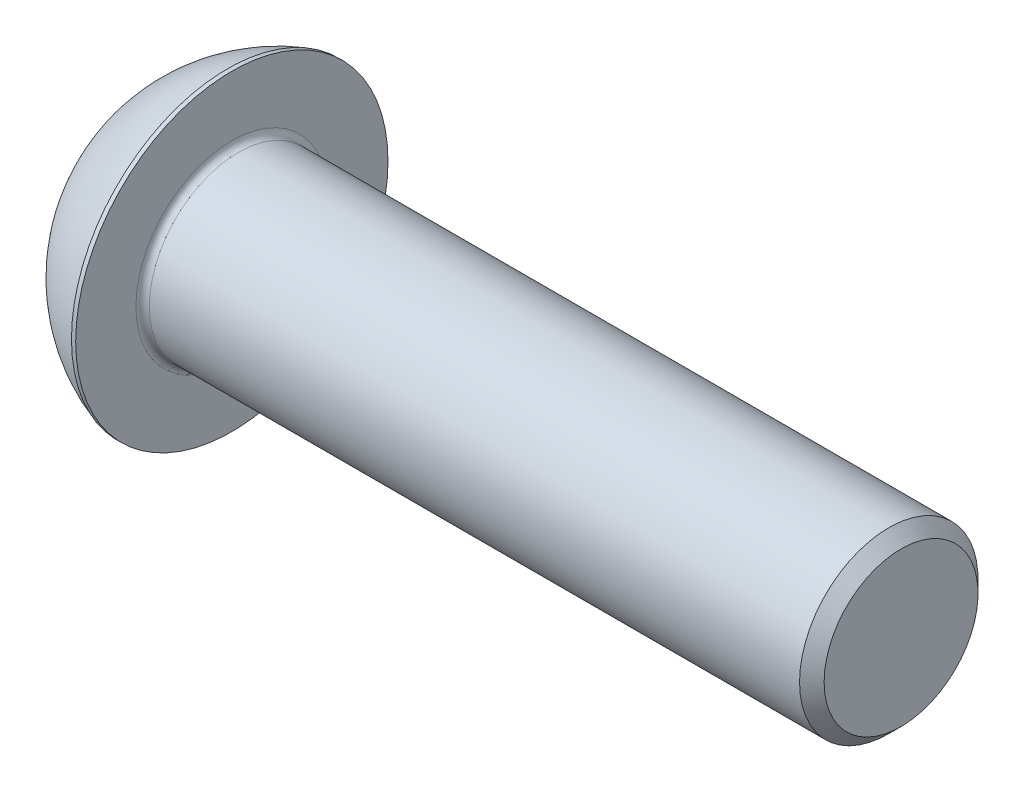
ISO-10303-21;
HEADER;
FILE_DESCRIPTION(('STEP AP214'),'2;1');
FILE_NAME('part.step','',(''),(''),'','','');
FILE_SCHEMA(('AUTOMOTIVE_DESIGN { 1 0 10303 214 1 1 1 1 }'));
ENDSEC;
DATA;
#1=APPLICATION_CONTEXT('core data for automotive mechanical design processes');
#2=APPLICATION_PROTOCOL_DEFINITION('international standard','automotive_design',2000,#1);
#3=PRODUCT_CONTEXT('',#1,'mechanical');
#4=PRODUCT('Part','Part','',(#3));
#5=PRODUCT_RELATED_PRODUCT_CATEGORY('part','',(#4));
#6=PRODUCT_DEFINITION_FORMATION('','',#4);
#7=PRODUCT_DEFINITION_CONTEXT('part definition',#1,'design');
#8=PRODUCT_DEFINITION('design','',#6,#7);
#9=PRODUCT_DEFINITION_SHAPE('','',#8);
#10=(LENGTH_UNIT() NAMED_UNIT(*) SI_UNIT(.MILLI.,.METRE.));
#11=(NAMED_UNIT(*) PLANE_ANGLE_UNIT() SI_UNIT($,.RADIAN.));
#12=(NAMED_UNIT(*) SI_UNIT($,.STERADIAN.) SOLID_ANGLE_UNIT());
#13=UNCERTAINTY_MEASURE_WITH_UNIT(LENGTH_MEASURE(1.E-05),#10,'distance_accuracy_value','');
#14=(GEOMETRIC_REPRESENTATION_CONTEXT(3) GLOBAL_UNCERTAINTY_ASSIGNED_CONTEXT((#13)) GLOBAL_UNIT_ASSIGNED_CONTEXT((#10,
#11,#12)) REPRESENTATION_CONTEXT('',''));
#15=CARTESIAN_POINT('',(0.,0.,0.));
#16=DIRECTION('',(0.,0.,1.));
#17=DIRECTION('',(1.,0.,0.));
#18=AXIS2_PLACEMENT_3D('',#15,#16,#17);
#19=CARTESIAN_POINT('',(0.,0.,0.));
#20=DIRECTION('',(-1.,0.,0.));
#21=DIRECTION('',(0.,0.,1.));
#22=AXIS2_PLACEMENT_3D('',#19,#20,#21);
#23=PLANE('',#22);
#24=CARTESIAN_POINT('',(0.,0.,0.));
#25=DIRECTION('',(-1.,0.,0.));
#26=DIRECTION('',(0.,0.,1.));
#27=AXIS2_PLACEMENT_3D('',#24,#25,#26);
#28=CIRCLE('',#27,7.);
#29=CARTESIAN_POINT('',(0.,0.,7.));
#30=VERTEX_POINT('',#29);
#31=EDGE_CURVE('E157',#30,#30,#28,.T.);
#32=ORIENTED_EDGE('',*,*,#31,.T.);
#33=EDGE_LOOP('',(#32));
#34=FACE_BOUND('',#33,.T.);
#35=DIRECTION('',(0.,-1.,0.));
#36=VECTOR('',#35,1.);
#37=CARTESIAN_POINT('',(0.,-2.88675134594813,5.));
#38=LINE('',#37,#36);
#39=CARTESIAN_POINT('',(0.,2.88675134594813,5.));
#40=VERTEX_POINT('',#39);
#41=CARTESIAN_POINT('',(0.,-2.88675134594813,5.));
#42=VERTEX_POINT('',#41);
#43=EDGE_CURVE('E47',#40,#42,#38,.T.);
#44=ORIENTED_EDGE('',*,*,#43,.T.);
#45=DIRECTION('',(0.,-0.5,-0.866025403784439));
#46=VECTOR('',#45,1.);
#47=CARTESIAN_POINT('',(0.,-5.77350269189626,0.));
#48=LINE('',#47,#46);
#49=CARTESIAN_POINT('',(0.,-5.77350269189626,0.));
#50=VERTEX_POINT('',#49);
#51=EDGE_CURVE('E250',#42,#50,#48,.T.);
#52=ORIENTED_EDGE('',*,*,#51,.T.);
#53=DIRECTION('',(0.,0.5,-0.866025403784439));
#54=VECTOR('',#53,1.);
#55=CARTESIAN_POINT('',(0.,-2.88675134594813,-5.));
#56=LINE('',#55,#54);
#57=CARTESIAN_POINT('',(0.,-2.88675134594813,-5.));
#58=VERTEX_POINT('',#57);
#59=EDGE_CURVE('E132',#50,#58,#56,.T.);
#60=ORIENTED_EDGE('',*,*,#59,.T.);
#61=DIRECTION('',(0.,1.,0.));
#62=VECTOR('',#61,1.);
#63=CARTESIAN_POINT('',(0.,2.88675134594813,-5.));
#64=LINE('',#63,#62);
#65=CARTESIAN_POINT('',(0.,2.88675134594813,-5.));
#66=VERTEX_POINT('',#65);
#67=EDGE_CURVE('E253',#58,#66,#64,.T.);
#68=ORIENTED_EDGE('',*,*,#67,.T.);
#69=DIRECTION('',(0.,0.5,0.866025403784439));
#70=VECTOR('',#69,1.);
#71=CARTESIAN_POINT('',(0.,5.77350269189626,0.));
#72=LINE('',#71,#70);
#73=CARTESIAN_POINT('',(0.,5.77350269189626,0.));
#74=VERTEX_POINT('',#73);
#75=EDGE_CURVE('E255',#66,#74,#72,.T.);
#76=ORIENTED_EDGE('',*,*,#75,.T.);
#77=DIRECTION('',(0.,-0.5,0.866025403784439));
#78=VECTOR('',#77,1.);
#79=CARTESIAN_POINT('',(0.,2.88675134594813,5.));
#80=LINE('',#79,#78);
#81=EDGE_CURVE('E257',#74,#40,#80,.T.);
#82=ORIENTED_EDGE('',*,*,#81,.T.);
#83=EDGE_LOOP('',(#44,#52,#60,#68,#76,#82));
#84=FACE_BOUND('',#83,.T.);
#85=ADVANCED_FACE('F32',(#34,#84),#23,.T.);
#86=CARTESIAN_POINT('',(12.939216152019,0.,0.));
#87=DIRECTION('',(-1.,0.,0.));
#88=DIRECTION('',(0.,1.,0.));
#89=AXIS2_PLACEMENT_3D('',#86,#87,#88);
#90=SPHERICAL_SURFACE('',#89,14.711332863771);
#91=CARTESIAN_POINT('',(8.42,0.,0.));
#92=DIRECTION('',(-1.,0.,0.));
#93=DIRECTION('',(0.,0.,1.));
#94=AXIS2_PLACEMENT_3D('',#91,#92,#93);
#95=CIRCLE('',#94,14.);
#96=CARTESIAN_POINT('',(8.42,0.,14.));
#97=VERTEX_POINT('',#96);
#98=EDGE_CURVE('E154',#97,#97,#95,.T.);
#99=ORIENTED_EDGE('',*,*,#98,.T.);
#100=EDGE_LOOP('',(#99));
#101=FACE_BOUND('',#100,.T.);
#102=ORIENTED_EDGE('',*,*,#31,.F.);
#103=EDGE_LOOP('',(#102));
#104=FACE_BOUND('',#103,.T.);
#105=ADVANCED_FACE('F178',(#101,#104),#90,.T.);
#106=CARTESIAN_POINT('',(0.,0.,0.));
#107=DIRECTION('',(-1.,0.,0.));
#108=DIRECTION('',(0.,0.,1.));
#109=AXIS2_PLACEMENT_3D('',#106,#107,#108);
#110=CYLINDRICAL_SURFACE('',#109,14.);
#111=ORIENTED_EDGE('',*,*,#98,.F.);
#112=EDGE_LOOP('',(#111));
#113=FACE_BOUND('',#112,.T.);
#114=CARTESIAN_POINT('',(8.8,0.,0.));
#115=DIRECTION('',(-1.,0.,0.));
#116=DIRECTION('',(0.,0.,1.));
#117=AXIS2_PLACEMENT_3D('',#114,#115,#116);
#118=CIRCLE('',#117,14.);
#119=CARTESIAN_POINT('',(8.8,0.,14.));
#120=VERTEX_POINT('',#119);
#121=EDGE_CURVE('E151',#120,#120,#118,.T.);
#122=ORIENTED_EDGE('',*,*,#121,.T.);
#123=EDGE_LOOP('',(#122));
#124=FACE_BOUND('',#123,.T.);
#125=ADVANCED_FACE('F183',(#113,#124),#110,.T.);
#126=CARTESIAN_POINT('',(8.8,8.,0.));
#127=DIRECTION('',(-1.,0.,0.));
#128=DIRECTION('',(0.,0.,1.));
#129=AXIS2_PLACEMENT_3D('',#126,#127,#128);
#130=PLANE('',#129);
#131=CARTESIAN_POINT('',(8.8,0.,0.));
#132=DIRECTION('',(-1.,0.,0.));
#133=DIRECTION('',(0.,0.,1.));
#134=AXIS2_PLACEMENT_3D('',#131,#132,#133);
#135=CIRCLE('',#134,8.6);
#136=CARTESIAN_POINT('',(8.8,0.,8.6));
#137=VERTEX_POINT('',#136);
#138=EDGE_CURVE('E40',#137,#137,#135,.T.);
#139=ORIENTED_EDGE('',*,*,#138,.T.);
#140=EDGE_LOOP('',(#139));
#141=FACE_BOUND('',#140,.T.);
#142=ORIENTED_EDGE('',*,*,#121,.F.);
#143=EDGE_LOOP('',(#142));
#144=FACE_BOUND('',#143,.T.);
#145=ADVANCED_FACE('F162',(#141,#144),#130,.F.);
#146=CARTESIAN_POINT('',(0.,0.,0.));
#147=DIRECTION('',(-1.,0.,0.));
#148=DIRECTION('',(0.,0.,1.));
#149=AXIS2_PLACEMENT_3D('',#146,#147,#148);
#150=CYLINDRICAL_SURFACE('',#149,8.);
#151=CARTESIAN_POINT('',(9.4,0.,0.));
#152=DIRECTION('',(-1.,0.,0.));
#153=DIRECTION('',(0.,0.,1.));
#154=AXIS2_PLACEMENT_3D('',#151,#152,#153);
#155=CIRCLE('',#154,8.);
#156=CARTESIAN_POINT('',(9.4,0.,8.));
#157=VERTEX_POINT('',#156);
#158=EDGE_CURVE('E11',#157,#157,#155,.F.);
#159=ORIENTED_EDGE('',*,*,#158,.T.);
#160=EDGE_LOOP('',(#159));
#161=FACE_BOUND('',#160,.T.);
#162=CARTESIAN_POINT('',(67.6985,0.,0.));
#163=DIRECTION('',(-1.,0.,0.));
#164=DIRECTION('',(0.,0.,1.));
#165=AXIS2_PLACEMENT_3D('',#162,#163,#164);
#166=CIRCLE('',#165,8.);
#167=CARTESIAN_POINT('',(67.6985,0.,8.));
#168=VERTEX_POINT('',#167);
#169=EDGE_CURVE('E148',#168,#168,#166,.T.);
#170=ORIENTED_EDGE('',*,*,#169,.T.);
#171=EDGE_LOOP('',(#170));
#172=FACE_BOUND('',#171,.T.);
#173=ADVANCED_FACE('F192',(#161,#172),#150,.T.);
#174=CARTESIAN_POINT('',(68.8,0.,0.));
#175=DIRECTION('',(-1.,0.,0.));
#176=DIRECTION('',(0.,0.,1.));
#177=AXIS2_PLACEMENT_3D('',#174,#175,#176);
#178=CONICAL_SURFACE('',#177,6.8985,0.78539816339744);
#179=ORIENTED_EDGE('',*,*,#169,.F.);
#180=EDGE_LOOP('',(#179));
#181=FACE_BOUND('',#180,.T.);
#182=CARTESIAN_POINT('',(68.8,0.,0.));
#183=DIRECTION('',(-1.,0.,0.));
#184=DIRECTION('',(0.,0.,1.));
#185=AXIS2_PLACEMENT_3D('',#182,#183,#184);
#186=CIRCLE('',#185,6.8985);
#187=CARTESIAN_POINT('',(68.8,0.,6.8985));
#188=VERTEX_POINT('',#187);
#189=EDGE_CURVE('E144',#188,#188,#186,.T.);
#190=ORIENTED_EDGE('',*,*,#189,.T.);
#191=EDGE_LOOP('',(#190));
#192=FACE_BOUND('',#191,.T.);
#193=ADVANCED_FACE('F173',(#181,#192),#178,.T.);
#194=CARTESIAN_POINT('',(68.8,0.,0.));
#195=DIRECTION('',(-1.,0.,0.));
#196=DIRECTION('',(0.,0.,1.));
#197=AXIS2_PLACEMENT_3D('',#194,#195,#196);
#198=PLANE('',#197);
#199=ORIENTED_EDGE('',*,*,#189,.F.);
#200=EDGE_LOOP('',(#199));
#201=FACE_BOUND('',#200,.T.);
#202=ADVANCED_FACE('F166',(#201),#198,.F.);
#203=CARTESIAN_POINT('',(9.4,0.,0.));
#204=DIRECTION('',(-1.,0.,0.));
#205=DIRECTION('',(0.,0.,1.));
#206=AXIS2_PLACEMENT_3D('',#203,#204,#205);
#207=TOROIDAL_SURFACE('',#206,8.6,0.6);
#208=ORIENTED_EDGE('',*,*,#158,.F.);
#209=EDGE_LOOP('',(#208));
#210=FACE_BOUND('',#209,.T.);
#211=ORIENTED_EDGE('',*,*,#138,.F.);
#212=EDGE_LOOP('',(#211));
#213=FACE_BOUND('',#212,.T.);
#214=ADVANCED_FACE('F34',(#210,#213),#207,.F.);
#215=CARTESIAN_POINT('',(3.0988,-5.77350269189626,0.));
#216=DIRECTION('',(0.,0.866025403784439,-0.5));
#217=DIRECTION('',(0.,0.5,0.866025403784439));
#218=AXIS2_PLACEMENT_3D('',#215,#216,#217);
#219=PLANE('',#218);
#220=DIRECTION('',(0.,-0.5,-0.866025403784439));
#221=VECTOR('',#220,1.);
#222=CARTESIAN_POINT('',(3.0988,-5.77350269189626,0.));
#223=LINE('',#222,#221);
#224=CARTESIAN_POINT('',(3.0988,-2.88675134594813,5.));
#225=VERTEX_POINT('',#224);
#226=CARTESIAN_POINT('',(3.0988,-4.33012701892219,2.5));
#227=VERTEX_POINT('',#226);
#228=EDGE_CURVE('E115',#225,#227,#223,.T.);
#229=ORIENTED_EDGE('',*,*,#228,.T.);
#230=CARTESIAN_POINT('',(3.0988,-5.77350269189626,0.));
#231=VERTEX_POINT('',#230);
#232=EDGE_CURVE('E108',#227,#231,#223,.T.);
#233=ORIENTED_EDGE('',*,*,#232,.T.);
#234=DIRECTION('',(-1.,0.,0.));
#235=VECTOR('',#234,1.);
#236=CARTESIAN_POINT('',(3.0988,-5.77350269189626,0.));
#237=LINE('',#236,#235);
#238=EDGE_CURVE('E112',#231,#50,#237,.T.);
#239=ORIENTED_EDGE('',*,*,#238,.T.);
#240=ORIENTED_EDGE('',*,*,#51,.F.);
#241=DIRECTION('',(-1.,0.,0.));
#242=VECTOR('',#241,1.);
#243=CARTESIAN_POINT('',(3.0988,-2.88675134594813,5.));
#244=LINE('',#243,#242);
#245=EDGE_CURVE('E240',#225,#42,#244,.T.);
#246=ORIENTED_EDGE('',*,*,#245,.F.);
#247=EDGE_LOOP('',(#229,#233,#239,#240,#246));
#248=FACE_BOUND('',#247,.T.);
#249=ADVANCED_FACE('F110',(#248),#219,.T.);
#250=CARTESIAN_POINT('',(3.0988,-2.88675134594813,-5.));
#251=DIRECTION('',(0.,0.866025403784439,0.5));
#252=DIRECTION('',(0.,-0.5,0.866025403784439));
#253=AXIS2_PLACEMENT_3D('',#250,#251,#252);
#254=PLANE('',#253);
#255=DIRECTION('',(0.,0.5,-0.866025403784439));
#256=VECTOR('',#255,1.);
#257=CARTESIAN_POINT('',(3.0988,-2.88675134594813,-5.));
#258=LINE('',#257,#256);
#259=CARTESIAN_POINT('',(3.0988,-4.33012701892219,-2.5));
#260=VERTEX_POINT('',#259);
#261=EDGE_CURVE('E120',#231,#260,#258,.T.);
#262=ORIENTED_EDGE('',*,*,#261,.T.);
#263=CARTESIAN_POINT('',(3.0988,-2.88675134594813,-5.));
#264=VERTEX_POINT('',#263);
#265=EDGE_CURVE('E127',#260,#264,#258,.T.);
#266=ORIENTED_EDGE('',*,*,#265,.T.);
#267=DIRECTION('',(-1.,0.,0.));
#268=VECTOR('',#267,1.);
#269=CARTESIAN_POINT('',(3.0988,-2.88675134594813,-5.));
#270=LINE('',#269,#268);
#271=EDGE_CURVE('E134',#264,#58,#270,.T.);
#272=ORIENTED_EDGE('',*,*,#271,.T.);
#273=ORIENTED_EDGE('',*,*,#59,.F.);
#274=ORIENTED_EDGE('',*,*,#238,.F.);
#275=EDGE_LOOP('',(#262,#266,#272,#273,#274));
#276=FACE_BOUND('',#275,.T.);
#277=ADVANCED_FACE('F130',(#276),#254,.T.);
#278=CARTESIAN_POINT('',(3.0988,2.88675134594813,-5.));
#279=DIRECTION('',(0.,0.,1.));
#280=DIRECTION('',(1.,0.,0.));
#281=AXIS2_PLACEMENT_3D('',#278,#279,#280);
#282=PLANE('',#281);
#283=DIRECTION('',(0.,1.,0.));
#284=VECTOR('',#283,1.);
#285=CARTESIAN_POINT('',(3.0988,2.88675134594813,-5.));
#286=LINE('',#285,#284);
#287=CARTESIAN_POINT('',(3.0988,0.,-5.));
#288=VERTEX_POINT('',#287);
#289=EDGE_CURVE('E276',#264,#288,#286,.T.);
#290=ORIENTED_EDGE('',*,*,#289,.T.);
#291=CARTESIAN_POINT('',(3.0988,2.88675134594813,-5.));
#292=VERTEX_POINT('',#291);
#293=EDGE_CURVE('E126',#288,#292,#286,.T.);
#294=ORIENTED_EDGE('',*,*,#293,.T.);
#295=DIRECTION('',(-1.,0.,0.));
#296=VECTOR('',#295,1.);
#297=CARTESIAN_POINT('',(3.0988,2.88675134594813,-5.));
#298=LINE('',#297,#296);
#299=EDGE_CURVE('E139',#292,#66,#298,.T.);
#300=ORIENTED_EDGE('',*,*,#299,.T.);
#301=ORIENTED_EDGE('',*,*,#67,.F.);
#302=ORIENTED_EDGE('',*,*,#271,.F.);
#303=EDGE_LOOP('',(#290,#294,#300,#301,#302));
#304=FACE_BOUND('',#303,.T.);
#305=ADVANCED_FACE('F206',(#304),#282,.T.);
#306=CARTESIAN_POINT('',(3.0988,5.77350269189626,0.));
#307=DIRECTION('',(0.,-0.866025403784439,0.5));
#308=DIRECTION('',(0.,-0.5,-0.866025403784439));
#309=AXIS2_PLACEMENT_3D('',#306,#307,#308);
#310=PLANE('',#309);
#311=DIRECTION('',(0.,0.5,0.866025403784439));
#312=VECTOR('',#311,1.);
#313=CARTESIAN_POINT('',(3.0988,5.77350269189626,0.));
#314=LINE('',#313,#312);
#315=CARTESIAN_POINT('',(3.0988,4.33012701892219,-2.5));
#316=VERTEX_POINT('',#315);
#317=EDGE_CURVE('E282',#292,#316,#314,.T.);
#318=ORIENTED_EDGE('',*,*,#317,.T.);
#319=CARTESIAN_POINT('',(3.0988,5.77350269189626,0.));
#320=VERTEX_POINT('',#319);
#321=EDGE_CURVE('E280',#316,#320,#314,.T.);
#322=ORIENTED_EDGE('',*,*,#321,.T.);
#323=DIRECTION('',(-1.,0.,0.));
#324=VECTOR('',#323,1.);
#325=CARTESIAN_POINT('',(3.0988,5.77350269189626,0.));
#326=LINE('',#325,#324);
#327=EDGE_CURVE('E262',#320,#74,#326,.T.);
#328=ORIENTED_EDGE('',*,*,#327,.T.);
#329=ORIENTED_EDGE('',*,*,#75,.F.);
#330=ORIENTED_EDGE('',*,*,#299,.F.);
#331=EDGE_LOOP('',(#318,#322,#328,#329,#330));
#332=FACE_BOUND('',#331,.T.);
#333=ADVANCED_FACE('F209',(#332),#310,.T.);
#334=CARTESIAN_POINT('',(3.0988,2.88675134594813,5.));
#335=DIRECTION('',(0.,-0.866025403784439,-0.5));
#336=DIRECTION('',(0.,0.5,-0.866025403784439));
#337=AXIS2_PLACEMENT_3D('',#334,#335,#336);
#338=PLANE('',#337);
#339=DIRECTION('',(0.,-0.5,0.866025403784439));
#340=VECTOR('',#339,1.);
#341=CARTESIAN_POINT('',(3.0988,2.88675134594813,5.));
#342=LINE('',#341,#340);
#343=CARTESIAN_POINT('',(3.0988,4.33012701892219,2.5));
#344=VERTEX_POINT('',#343);
#345=EDGE_CURVE('E246',#320,#344,#342,.T.);
#346=ORIENTED_EDGE('',*,*,#345,.T.);
#347=CARTESIAN_POINT('',(3.0988,2.88675134594813,5.));
#348=VERTEX_POINT('',#347);
#349=EDGE_CURVE('E238',#344,#348,#342,.T.);
#350=ORIENTED_EDGE('',*,*,#349,.T.);
#351=DIRECTION('',(-1.,0.,0.));
#352=VECTOR('',#351,1.);
#353=CARTESIAN_POINT('',(3.0988,2.88675134594813,5.));
#354=LINE('',#353,#352);
#355=EDGE_CURVE('E244',#348,#40,#354,.T.);
#356=ORIENTED_EDGE('',*,*,#355,.T.);
#357=ORIENTED_EDGE('',*,*,#81,.F.);
#358=ORIENTED_EDGE('',*,*,#327,.F.);
#359=EDGE_LOOP('',(#346,#350,#356,#357,#358));
#360=FACE_BOUND('',#359,.T.);
#361=ADVANCED_FACE('F213',(#360),#338,.T.);
#362=CARTESIAN_POINT('',(3.0988,-2.88675134594813,5.));
#363=DIRECTION('',(0.,0.,-1.));
#364=DIRECTION('',(-1.,0.,0.));
#365=AXIS2_PLACEMENT_3D('',#362,#363,#364);
#366=PLANE('',#365);
#367=DIRECTION('',(0.,-1.,0.));
#368=VECTOR('',#367,1.);
#369=CARTESIAN_POINT('',(3.0988,-2.88675134594813,5.));
#370=LINE('',#369,#368);
#371=CARTESIAN_POINT('',(3.0988,0.,5.));
#372=VERTEX_POINT('',#371);
#373=EDGE_CURVE('E55',#348,#372,#370,.T.);
#374=ORIENTED_EDGE('',*,*,#373,.T.);
#375=EDGE_CURVE('E241',#372,#225,#370,.T.);
#376=ORIENTED_EDGE('',*,*,#375,.T.);
#377=ORIENTED_EDGE('',*,*,#245,.T.);
#378=ORIENTED_EDGE('',*,*,#43,.F.);
#379=ORIENTED_EDGE('',*,*,#355,.F.);
#380=EDGE_LOOP('',(#374,#376,#377,#378,#379));
#381=FACE_BOUND('',#380,.T.);
#382=ADVANCED_FACE('F217',(#381),#366,.T.);
#383=CARTESIAN_POINT('',(3.0988,-2.88675134594813,5.));
#384=DIRECTION('',(-1.,0.,0.));
#385=DIRECTION('',(0.,0.,1.));
#386=AXIS2_PLACEMENT_3D('',#383,#384,#385);
#387=PLANE('',#386);
#388=ORIENTED_EDGE('',*,*,#373,.F.);
#389=ORIENTED_EDGE('',*,*,#349,.F.);
#390=CARTESIAN_POINT('',(3.0988,0.,0.));
#391=DIRECTION('',(-1.,0.,0.));
#392=DIRECTION('',(0.,0.,1.));
#393=AXIS2_PLACEMENT_3D('',#390,#391,#392);
#394=CIRCLE('',#393,5.);
#395=EDGE_CURVE('E138',#372,#344,#394,.T.);
#396=ORIENTED_EDGE('',*,*,#395,.F.);
#397=EDGE_LOOP('',(#388,#389,#396));
#398=FACE_BOUND('',#397,.T.);
#399=ADVANCED_FACE('F221',(#398),#387,.T.);
#400=ORIENTED_EDGE('',*,*,#345,.F.);
#401=ORIENTED_EDGE('',*,*,#321,.F.);
#402=EDGE_CURVE('E145',#344,#316,#394,.T.);
#403=ORIENTED_EDGE('',*,*,#402,.F.);
#404=EDGE_LOOP('',(#400,#401,#403));
#405=FACE_BOUND('',#404,.T.);
#406=ADVANCED_FACE('F229',(#405),#387,.T.);
#407=ORIENTED_EDGE('',*,*,#317,.F.);
#408=ORIENTED_EDGE('',*,*,#293,.F.);
#409=EDGE_CURVE('E287',#316,#288,#394,.T.);
#410=ORIENTED_EDGE('',*,*,#409,.F.);
#411=EDGE_LOOP('',(#407,#408,#410));
#412=FACE_BOUND('',#411,.T.);
#413=ADVANCED_FACE('F234',(#412),#387,.T.);
#414=ORIENTED_EDGE('',*,*,#289,.F.);
#415=ORIENTED_EDGE('',*,*,#265,.F.);
#416=EDGE_CURVE('E279',#288,#260,#394,.T.);
#417=ORIENTED_EDGE('',*,*,#416,.F.);
#418=EDGE_LOOP('',(#414,#415,#417));
#419=FACE_BOUND('',#418,.T.);
#420=ADVANCED_FACE('F227',(#419),#387,.T.);
#421=ORIENTED_EDGE('',*,*,#261,.F.);
#422=ORIENTED_EDGE('',*,*,#232,.F.);
#423=EDGE_CURVE('E122',#260,#227,#394,.T.);
#424=ORIENTED_EDGE('',*,*,#423,.F.);
#425=EDGE_LOOP('',(#421,#422,#424));
#426=FACE_BOUND('',#425,.T.);
#427=ADVANCED_FACE('F121',(#426),#387,.T.);
#428=ORIENTED_EDGE('',*,*,#228,.F.);
#429=ORIENTED_EDGE('',*,*,#375,.F.);
#430=EDGE_CURVE('E133',#227,#372,#394,.T.);
#431=ORIENTED_EDGE('',*,*,#430,.F.);
#432=EDGE_LOOP('',(#428,#429,#431));
#433=FACE_BOUND('',#432,.T.);
#434=ADVANCED_FACE('F201',(#433),#387,.T.);
#435=CARTESIAN_POINT('',(5.98555134594816,0.,0.));
#436=DIRECTION('',(-1.,0.,0.));
#437=DIRECTION('',(0.,0.,1.));
#438=AXIS2_PLACEMENT_3D('',#435,#436,#437);
#439=CONICAL_SURFACE('',#438,0.,1.04719755119659);
#440=ORIENTED_EDGE('',*,*,#395,.T.);
#441=ORIENTED_EDGE('',*,*,#402,.T.);
#442=ORIENTED_EDGE('',*,*,#409,.T.);
#443=ORIENTED_EDGE('',*,*,#416,.T.);
#444=ORIENTED_EDGE('',*,*,#423,.T.);
#445=ORIENTED_EDGE('',*,*,#430,.T.);
#446=EDGE_LOOP('',(#440,#441,#442,#443,#444,#445));
#447=FACE_BOUND('',#446,.T.);
#448=CARTESIAN_POINT('',(5.98555134594816,0.,0.));
#449=VERTEX_POINT('',#448);
#450=VERTEX_LOOP('',#449);
#451=FACE_BOUND('',#450,.T.);
#452=ADVANCED_FACE('F199',(#447,#451),#439,.F.);
#453=CLOSED_SHELL('',(#85,#105,#125,#145,#173,#193,#202,#214,#249,#277,#305,#333,#361,#382,#399,
#406,#413,#420,#427,#434,#452));
#454=MANIFOLD_SOLID_BREP('B2',#453);
#455=ADVANCED_BREP_SHAPE_REPRESENTATION('',(#18,#454),#14);
#456=SHAPE_DEFINITION_REPRESENTATION(#9,#455);
ENDSEC;
END-ISO-10303-21;
